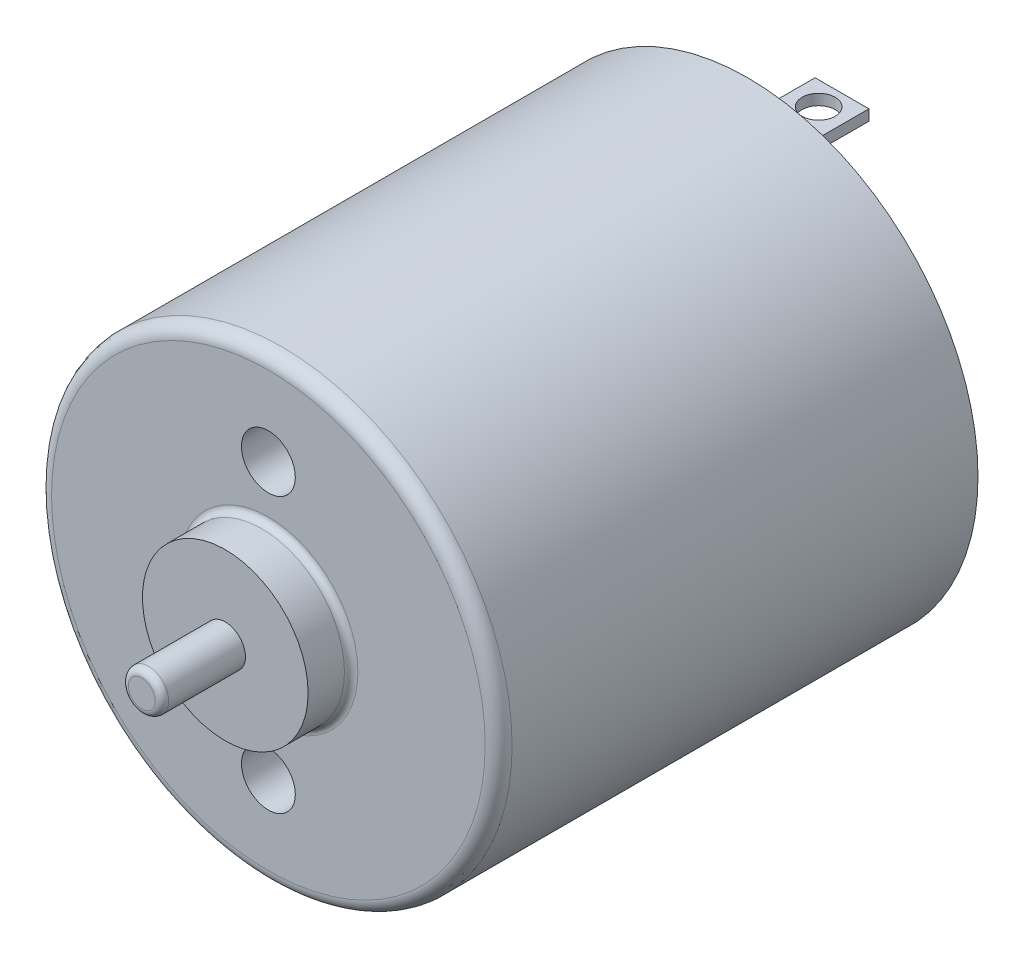
ISO-10303-21;
HEADER;
FILE_DESCRIPTION(('STEP AP214'),'2;1');
FILE_NAME('part.step','',(''),(''),'','','');
FILE_SCHEMA(('AUTOMOTIVE_DESIGN { 1 0 10303 214 1 1 1 1 }'));
ENDSEC;
DATA;
#1=APPLICATION_CONTEXT('core data for automotive mechanical design processes');
#2=APPLICATION_PROTOCOL_DEFINITION('international standard','automotive_design',2000,#1);
#3=PRODUCT_CONTEXT('',#1,'mechanical');
#4=PRODUCT('Part','Part','',(#3));
#5=PRODUCT_RELATED_PRODUCT_CATEGORY('part','',(#4));
#6=PRODUCT_DEFINITION_FORMATION('','',#4);
#7=PRODUCT_DEFINITION_CONTEXT('part definition',#1,'design');
#8=PRODUCT_DEFINITION('design','',#6,#7);
#9=PRODUCT_DEFINITION_SHAPE('','',#8);
#10=(LENGTH_UNIT() NAMED_UNIT(*) SI_UNIT(.MILLI.,.METRE.));
#11=(NAMED_UNIT(*) PLANE_ANGLE_UNIT() SI_UNIT($,.RADIAN.));
#12=(NAMED_UNIT(*) SI_UNIT($,.STERADIAN.) SOLID_ANGLE_UNIT());
#13=UNCERTAINTY_MEASURE_WITH_UNIT(LENGTH_MEASURE(1.E-05),#10,'distance_accuracy_value','');
#14=(GEOMETRIC_REPRESENTATION_CONTEXT(3) GLOBAL_UNCERTAINTY_ASSIGNED_CONTEXT((#13)) GLOBAL_UNIT_ASSIGNED_CONTEXT((#10,
#11,#12)) REPRESENTATION_CONTEXT('',''));
#15=CARTESIAN_POINT('',(0.,0.,0.));
#16=DIRECTION('',(0.,0.,1.));
#17=DIRECTION('',(1.,0.,0.));
#18=AXIS2_PLACEMENT_3D('',#15,#16,#17);
#19=CARTESIAN_POINT('',(0.,0.,0.));
#20=DIRECTION('',(0.,0.,1.));
#21=DIRECTION('',(1.,0.,0.));
#22=AXIS2_PLACEMENT_3D('',#19,#20,#21);
#23=PLANE('',#22);
#24=CARTESIAN_POINT('',(0.,0.,0.));
#25=DIRECTION('',(0.,0.,-1.));
#26=DIRECTION('',(-1.,0.,0.));
#27=AXIS2_PLACEMENT_3D('',#24,#25,#26);
#28=CIRCLE('',#27,8.3);
#29=CARTESIAN_POINT('',(-8.3,0.,0.));
#30=VERTEX_POINT('',#29);
#31=EDGE_CURVE('E56',#30,#30,#28,.T.);
#32=ORIENTED_EDGE('',*,*,#31,.F.);
#33=EDGE_LOOP('',(#32));
#34=FACE_BOUND('',#33,.T.);
#35=CARTESIAN_POINT('',(0.,0.,0.));
#36=DIRECTION('',(0.,0.,1.));
#37=DIRECTION('',(1.,0.,0.));
#38=AXIS2_PLACEMENT_3D('',#35,#36,#37);
#39=CIRCLE('',#38,8.55);
#40=CARTESIAN_POINT('',(8.55,0.,0.));
#41=VERTEX_POINT('',#40);
#42=EDGE_CURVE('E80',#41,#41,#39,.T.);
#43=ORIENTED_EDGE('',*,*,#42,.F.);
#44=EDGE_LOOP('',(#43));
#45=FACE_BOUND('',#44,.T.);
#46=ADVANCED_FACE('F41',(#34,#45),#23,.F.);
#47=CARTESIAN_POINT('',(0.,0.,17.8));
#48=DIRECTION('',(0.,0.,-1.));
#49=DIRECTION('',(-1.,0.,0.));
#50=AXIS2_PLACEMENT_3D('',#47,#48,#49);
#51=CYLINDRICAL_SURFACE('',#50,8.55);
#52=CARTESIAN_POINT('',(0.,0.,17.3));
#53=DIRECTION('',(0.,0.,1.));
#54=DIRECTION('',(1.,0.,0.));
#55=AXIS2_PLACEMENT_3D('',#52,#53,#54);
#56=CIRCLE('',#55,8.55);
#57=CARTESIAN_POINT('',(8.55,0.,17.3));
#58=VERTEX_POINT('',#57);
#59=EDGE_CURVE('E84',#58,#58,#56,.F.);
#60=ORIENTED_EDGE('',*,*,#59,.T.);
#61=EDGE_LOOP('',(#60));
#62=FACE_BOUND('',#61,.T.);
#63=ORIENTED_EDGE('',*,*,#42,.T.);
#64=EDGE_LOOP('',(#63));
#65=FACE_BOUND('',#64,.T.);
#66=ADVANCED_FACE('F125',(#62,#65),#51,.T.);
#67=CARTESIAN_POINT('',(0.,0.,17.8));
#68=DIRECTION('',(0.,0.,1.));
#69=DIRECTION('',(1.,0.,0.));
#70=AXIS2_PLACEMENT_3D('',#67,#68,#69);
#71=PLANE('',#70);
#72=CARTESIAN_POINT('',(0.,0.,17.8));
#73=DIRECTION('',(0.,0.,1.));
#74=DIRECTION('',(1.,0.,0.));
#75=AXIS2_PLACEMENT_3D('',#72,#73,#74);
#76=CIRCLE('',#75,3.325);
#77=CARTESIAN_POINT('',(3.325,0.,17.8));
#78=VERTEX_POINT('',#77);
#79=EDGE_CURVE('E83',#78,#78,#76,.F.);
#80=ORIENTED_EDGE('',*,*,#79,.T.);
#81=EDGE_LOOP('',(#80));
#82=FACE_BOUND('',#81,.T.);
#83=CARTESIAN_POINT('',(0.,0.,17.8));
#84=DIRECTION('',(0.,0.,1.));
#85=DIRECTION('',(1.,0.,0.));
#86=AXIS2_PLACEMENT_3D('',#83,#84,#85);
#87=CIRCLE('',#86,8.05);
#88=CARTESIAN_POINT('',(8.05,0.,17.8));
#89=VERTEX_POINT('',#88);
#90=EDGE_CURVE('E85',#89,#89,#87,.T.);
#91=ORIENTED_EDGE('',*,*,#90,.T.);
#92=EDGE_LOOP('',(#91));
#93=FACE_BOUND('',#92,.T.);
#94=CARTESIAN_POINT('',(0.,-5.1,17.8));
#95=DIRECTION('',(0.,0.,1.));
#96=DIRECTION('',(1.,0.,0.));
#97=AXIS2_PLACEMENT_3D('',#94,#95,#96);
#98=CIRCLE('',#97,1.);
#99=CARTESIAN_POINT('',(1.,-5.1,17.8));
#100=VERTEX_POINT('',#99);
#101=EDGE_CURVE('E64',#100,#100,#98,.T.);
#102=ORIENTED_EDGE('',*,*,#101,.F.);
#103=EDGE_LOOP('',(#102));
#104=FACE_BOUND('',#103,.T.);
#105=CARTESIAN_POINT('',(0.,5.1,17.8));
#106=DIRECTION('',(0.,0.,1.));
#107=DIRECTION('',(1.,0.,0.));
#108=AXIS2_PLACEMENT_3D('',#105,#106,#107);
#109=CIRCLE('',#108,1.);
#110=CARTESIAN_POINT('',(0.999999999999998,5.1,17.8));
#111=VERTEX_POINT('',#110);
#112=EDGE_CURVE('E70',#111,#111,#109,.T.);
#113=ORIENTED_EDGE('',*,*,#112,.F.);
#114=EDGE_LOOP('',(#113));
#115=FACE_BOUND('',#114,.T.);
#116=ADVANCED_FACE('F95',(#82,#93,#104,#115),#71,.T.);
#117=CARTESIAN_POINT('',(0.,0.,19.4));
#118=DIRECTION('',(0.,0.,-1.));
#119=DIRECTION('',(-1.,0.,0.));
#120=AXIS2_PLACEMENT_3D('',#117,#118,#119);
#121=CYLINDRICAL_SURFACE('',#120,3.075);
#122=CARTESIAN_POINT('',(0.,0.,18.05));
#123=DIRECTION('',(0.,0.,1.));
#124=DIRECTION('',(1.,0.,0.));
#125=AXIS2_PLACEMENT_3D('',#122,#123,#124);
#126=CIRCLE('',#125,3.075);
#127=CARTESIAN_POINT('',(3.075,0.,18.05));
#128=VERTEX_POINT('',#127);
#129=EDGE_CURVE('E79',#128,#128,#126,.T.);
#130=ORIENTED_EDGE('',*,*,#129,.T.);
#131=EDGE_LOOP('',(#130));
#132=FACE_BOUND('',#131,.T.);
#133=CARTESIAN_POINT('',(0.,0.,19.4));
#134=DIRECTION('',(0.,0.,1.));
#135=DIRECTION('',(1.,0.,0.));
#136=AXIS2_PLACEMENT_3D('',#133,#134,#135);
#137=CIRCLE('',#136,3.075);
#138=CARTESIAN_POINT('',(3.075,0.,19.4));
#139=VERTEX_POINT('',#138);
#140=EDGE_CURVE('E76',#139,#139,#137,.T.);
#141=ORIENTED_EDGE('',*,*,#140,.F.);
#142=EDGE_LOOP('',(#141));
#143=FACE_BOUND('',#142,.T.);
#144=ADVANCED_FACE('F106',(#132,#143),#121,.T.);
#145=CARTESIAN_POINT('',(0.,0.,19.4));
#146=DIRECTION('',(0.,0.,1.));
#147=DIRECTION('',(1.,0.,0.));
#148=AXIS2_PLACEMENT_3D('',#145,#146,#147);
#149=PLANE('',#148);
#150=CARTESIAN_POINT('',(0.,0.,19.4));
#151=DIRECTION('',(0.,0.,1.));
#152=DIRECTION('',(1.,0.,0.));
#153=AXIS2_PLACEMENT_3D('',#150,#151,#152);
#154=CIRCLE('',#153,0.75);
#155=CARTESIAN_POINT('',(0.75,0.,19.4));
#156=VERTEX_POINT('',#155);
#157=EDGE_CURVE('E73',#156,#156,#154,.T.);
#158=ORIENTED_EDGE('',*,*,#157,.F.);
#159=EDGE_LOOP('',(#158));
#160=FACE_BOUND('',#159,.T.);
#161=ORIENTED_EDGE('',*,*,#140,.T.);
#162=EDGE_LOOP('',(#161));
#163=FACE_BOUND('',#162,.T.);
#164=ADVANCED_FACE('F109',(#160,#163),#149,.T.);
#165=CARTESIAN_POINT('',(0.,0.,29.3213203435596));
#166=DIRECTION('',(0.,0.,-1.));
#167=DIRECTION('',(-1.,0.,0.));
#168=AXIS2_PLACEMENT_3D('',#165,#166,#167);
#169=CYLINDRICAL_SURFACE('',#168,0.75);
#170=CARTESIAN_POINT('',(0.,0.,22.25));
#171=DIRECTION('',(0.,0.,1.));
#172=DIRECTION('',(1.,0.,0.));
#173=AXIS2_PLACEMENT_3D('',#170,#171,#172);
#174=CIRCLE('',#173,0.75);
#175=CARTESIAN_POINT('',(0.75,0.,22.25));
#176=VERTEX_POINT('',#175);
#177=EDGE_CURVE('E11',#176,#176,#174,.F.);
#178=ORIENTED_EDGE('',*,*,#177,.T.);
#179=EDGE_LOOP('',(#178));
#180=FACE_BOUND('',#179,.T.);
#181=ORIENTED_EDGE('',*,*,#157,.T.);
#182=EDGE_LOOP('',(#181));
#183=FACE_BOUND('',#182,.T.);
#184=ADVANCED_FACE('F114',(#180,#183),#169,.T.);
#185=CARTESIAN_POINT('',(0.,0.,22.5));
#186=DIRECTION('',(0.,0.,1.));
#187=DIRECTION('',(1.,0.,0.));
#188=AXIS2_PLACEMENT_3D('',#185,#186,#187);
#189=PLANE('',#188);
#190=CARTESIAN_POINT('',(0.,0.,22.5));
#191=DIRECTION('',(0.,0.,1.));
#192=DIRECTION('',(1.,0.,0.));
#193=AXIS2_PLACEMENT_3D('',#190,#191,#192);
#194=CIRCLE('',#193,0.5);
#195=CARTESIAN_POINT('',(0.5,0.,22.5));
#196=VERTEX_POINT('',#195);
#197=EDGE_CURVE('E48',#196,#196,#194,.T.);
#198=ORIENTED_EDGE('',*,*,#197,.T.);
#199=EDGE_LOOP('',(#198));
#200=FACE_BOUND('',#199,.T.);
#201=ADVANCED_FACE('F120',(#200),#189,.T.);
#202=CARTESIAN_POINT('',(0.,5.1,15.8));
#203=DIRECTION('',(0.,0.,1.));
#204=DIRECTION('',(1.,0.,0.));
#205=AXIS2_PLACEMENT_3D('',#202,#203,#204);
#206=CYLINDRICAL_SURFACE('',#205,1.);
#207=CARTESIAN_POINT('',(0.,5.1,15.8));
#208=DIRECTION('',(0.,0.,1.));
#209=DIRECTION('',(1.,0.,0.));
#210=AXIS2_PLACEMENT_3D('',#207,#208,#209);
#211=CIRCLE('',#210,1.);
#212=CARTESIAN_POINT('',(0.999999999999998,5.1,15.8));
#213=VERTEX_POINT('',#212);
#214=EDGE_CURVE('E67',#213,#213,#211,.T.);
#215=ORIENTED_EDGE('',*,*,#214,.F.);
#216=EDGE_LOOP('',(#215));
#217=FACE_BOUND('',#216,.T.);
#218=ORIENTED_EDGE('',*,*,#112,.T.);
#219=EDGE_LOOP('',(#218));
#220=FACE_BOUND('',#219,.T.);
#221=ADVANCED_FACE('F156',(#217,#220),#206,.F.);
#222=CARTESIAN_POINT('',(0.,5.1,15.8));
#223=DIRECTION('',(0.,0.,1.));
#224=DIRECTION('',(1.,0.,0.));
#225=AXIS2_PLACEMENT_3D('',#222,#223,#224);
#226=PLANE('',#225);
#227=ORIENTED_EDGE('',*,*,#214,.T.);
#228=EDGE_LOOP('',(#227));
#229=FACE_BOUND('',#228,.T.);
#230=ADVANCED_FACE('F161',(#229),#226,.T.);
#231=CARTESIAN_POINT('',(0.,-5.1,15.8));
#232=DIRECTION('',(0.,0.,1.));
#233=DIRECTION('',(1.,0.,0.));
#234=AXIS2_PLACEMENT_3D('',#231,#232,#233);
#235=CYLINDRICAL_SURFACE('',#234,1.);
#236=CARTESIAN_POINT('',(0.,-5.1,15.8));
#237=DIRECTION('',(0.,0.,1.));
#238=DIRECTION('',(1.,0.,0.));
#239=AXIS2_PLACEMENT_3D('',#236,#237,#238);
#240=CIRCLE('',#239,1.);
#241=CARTESIAN_POINT('',(1.,-5.1,15.8));
#242=VERTEX_POINT('',#241);
#243=EDGE_CURVE('E61',#242,#242,#240,.T.);
#244=ORIENTED_EDGE('',*,*,#243,.F.);
#245=EDGE_LOOP('',(#244));
#246=FACE_BOUND('',#245,.T.);
#247=ORIENTED_EDGE('',*,*,#101,.T.);
#248=EDGE_LOOP('',(#247));
#249=FACE_BOUND('',#248,.T.);
#250=ADVANCED_FACE('F173',(#246,#249),#235,.F.);
#251=CARTESIAN_POINT('',(0.,-5.1,15.8));
#252=DIRECTION('',(0.,0.,1.));
#253=DIRECTION('',(1.,0.,0.));
#254=AXIS2_PLACEMENT_3D('',#251,#252,#253);
#255=PLANE('',#254);
#256=ORIENTED_EDGE('',*,*,#243,.T.);
#257=EDGE_LOOP('',(#256));
#258=FACE_BOUND('',#257,.T.);
#259=ADVANCED_FACE('F183',(#258),#255,.T.);
#260=CARTESIAN_POINT('',(0.,0.,17.3));
#261=DIRECTION('',(0.,0.,1.));
#262=DIRECTION('',(1.,0.,0.));
#263=AXIS2_PLACEMENT_3D('',#260,#261,#262);
#264=TOROIDAL_SURFACE('',#263,8.05,0.5);
#265=ORIENTED_EDGE('',*,*,#59,.F.);
#266=EDGE_LOOP('',(#265));
#267=FACE_BOUND('',#266,.T.);
#268=ORIENTED_EDGE('',*,*,#90,.F.);
#269=EDGE_LOOP('',(#268));
#270=FACE_BOUND('',#269,.T.);
#271=ADVANCED_FACE('F102',(#267,#270),#264,.T.);
#272=CARTESIAN_POINT('',(0.,0.,18.05));
#273=DIRECTION('',(0.,0.,1.));
#274=DIRECTION('',(1.,0.,0.));
#275=AXIS2_PLACEMENT_3D('',#272,#273,#274);
#276=TOROIDAL_SURFACE('',#275,3.325,0.25);
#277=ORIENTED_EDGE('',*,*,#79,.F.);
#278=EDGE_LOOP('',(#277));
#279=FACE_BOUND('',#278,.T.);
#280=ORIENTED_EDGE('',*,*,#129,.F.);
#281=EDGE_LOOP('',(#280));
#282=FACE_BOUND('',#281,.T.);
#283=ADVANCED_FACE('F98',(#279,#282),#276,.F.);
#284=CARTESIAN_POINT('',(0.,0.,0.5));
#285=DIRECTION('',(0.,0.,-1.));
#286=DIRECTION('',(-1.,0.,0.));
#287=AXIS2_PLACEMENT_3D('',#284,#285,#286);
#288=CYLINDRICAL_SURFACE('',#287,8.3);
#289=CARTESIAN_POINT('',(0.,0.,0.5));
#290=DIRECTION('',(0.,0.,-1.));
#291=DIRECTION('',(-1.,0.,0.));
#292=AXIS2_PLACEMENT_3D('',#289,#290,#291);
#293=CIRCLE('',#292,8.3);
#294=CARTESIAN_POINT('',(-8.3,0.,0.5));
#295=VERTEX_POINT('',#294);
#296=EDGE_CURVE('E52',#295,#295,#293,.T.);
#297=ORIENTED_EDGE('',*,*,#296,.F.);
#298=EDGE_LOOP('',(#297));
#299=FACE_BOUND('',#298,.T.);
#300=ORIENTED_EDGE('',*,*,#31,.T.);
#301=EDGE_LOOP('',(#300));
#302=FACE_BOUND('',#301,.T.);
#303=ADVANCED_FACE('F101',(#299,#302),#288,.F.);
#304=CARTESIAN_POINT('',(0.,0.,0.5));
#305=DIRECTION('',(0.,0.,-1.));
#306=DIRECTION('',(-1.,0.,0.));
#307=AXIS2_PLACEMENT_3D('',#304,#305,#306);
#308=PLANE('',#307);
#309=ORIENTED_EDGE('',*,*,#296,.T.);
#310=EDGE_LOOP('',(#309));
#311=FACE_BOUND('',#310,.T.);
#312=ADVANCED_FACE('F216',(#311),#308,.T.);
#313=CARTESIAN_POINT('',(0.,0.,22.25));
#314=DIRECTION('',(0.,0.,1.));
#315=DIRECTION('',(1.,0.,0.));
#316=AXIS2_PLACEMENT_3D('',#313,#314,#315);
#317=TOROIDAL_SURFACE('',#316,0.5,0.25);
#318=ORIENTED_EDGE('',*,*,#177,.F.);
#319=EDGE_LOOP('',(#318));
#320=FACE_BOUND('',#319,.T.);
#321=ORIENTED_EDGE('',*,*,#197,.F.);
#322=EDGE_LOOP('',(#321));
#323=FACE_BOUND('',#322,.T.);
#324=ADVANCED_FACE('F43',(#320,#323),#317,.T.);
#325=CLOSED_SHELL('',(#46,#66,#116,#144,#164,#184,#201,#221,#230,#250,#259,#271,#283,#303,#312,#324));
#326=MANIFOLD_SOLID_BREP('B2',#325);
#327=CARTESIAN_POINT('',(0.,0.,-3.5));
#328=DIRECTION('',(0.,0.,1.));
#329=DIRECTION('',(1.,0.,0.));
#330=AXIS2_PLACEMENT_3D('',#327,#328,#329);
#331=PLANE('',#330);
#332=DIRECTION('',(0.,1.,0.));
#333=VECTOR('',#332,1.);
#334=CARTESIAN_POINT('',(-0.999999999999997,-6.3,-3.5));
#335=LINE('',#334,#333);
#336=CARTESIAN_POINT('',(-0.999999999999997,-6.3,-3.5));
#337=VERTEX_POINT('',#336);
#338=CARTESIAN_POINT('',(-0.999999999999997,-5.9,-3.5));
#339=VERTEX_POINT('',#338);
#340=EDGE_CURVE('E353',#337,#339,#335,.T.);
#341=ORIENTED_EDGE('',*,*,#340,.T.);
#342=DIRECTION('',(1.,0.,0.));
#343=VECTOR('',#342,1.);
#344=CARTESIAN_POINT('',(1.,-5.9,-3.5));
#345=LINE('',#344,#343);
#346=CARTESIAN_POINT('',(1.,-5.9,-3.5));
#347=VERTEX_POINT('',#346);
#348=EDGE_CURVE('E352',#339,#347,#345,.T.);
#349=ORIENTED_EDGE('',*,*,#348,.T.);
#350=DIRECTION('',(0.,-1.,0.));
#351=VECTOR('',#350,1.);
#352=CARTESIAN_POINT('',(1.,-6.3,-3.5));
#353=LINE('',#352,#351);
#354=CARTESIAN_POINT('',(1.,-6.3,-3.5));
#355=VERTEX_POINT('',#354);
#356=EDGE_CURVE('E350',#347,#355,#353,.T.);
#357=ORIENTED_EDGE('',*,*,#356,.T.);
#358=DIRECTION('',(-1.,0.,0.));
#359=VECTOR('',#358,1.);
#360=CARTESIAN_POINT('',(1.,-6.3,-3.5));
#361=LINE('',#360,#359);
#362=EDGE_CURVE('E329',#355,#337,#361,.T.);
#363=ORIENTED_EDGE('',*,*,#362,.T.);
#364=EDGE_LOOP('',(#341,#349,#357,#363));
#365=FACE_BOUND('',#364,.T.);
#366=ADVANCED_FACE('F286',(#365),#331,.F.);
#367=CARTESIAN_POINT('',(1.,-6.3,-3.5));
#368=DIRECTION('',(0.,1.,0.));
#369=DIRECTION('',(0.,0.,1.));
#370=AXIS2_PLACEMENT_3D('',#367,#368,#369);
#371=PLANE('',#370);
#372=CARTESIAN_POINT('',(0.,-6.3,-2.63292970690516));
#373=DIRECTION('',(0.,1.,0.));
#374=DIRECTION('',(0.,0.,1.));
#375=AXIS2_PLACEMENT_3D('',#372,#373,#374);
#376=CIRCLE('',#375,0.613220662913288);
#377=CARTESIAN_POINT('',(0.,-6.3,-2.01970904399187));
#378=VERTEX_POINT('',#377);
#379=EDGE_CURVE('E355',#378,#378,#376,.T.);
#380=ORIENTED_EDGE('',*,*,#379,.T.);
#381=EDGE_LOOP('',(#380));
#382=FACE_BOUND('',#381,.T.);
#383=DIRECTION('',(-1.,0.,0.));
#384=VECTOR('',#383,1.);
#385=CARTESIAN_POINT('',(1.,-6.3,0.));
#386=LINE('',#385,#384);
#387=CARTESIAN_POINT('',(1.,-6.3,0.));
#388=VERTEX_POINT('',#387);
#389=CARTESIAN_POINT('',(-0.999999999999997,-6.3,0.));
#390=VERTEX_POINT('',#389);
#391=EDGE_CURVE('E324',#388,#390,#386,.T.);
#392=ORIENTED_EDGE('',*,*,#391,.T.);
#393=DIRECTION('',(0.,0.,1.));
#394=VECTOR('',#393,1.);
#395=CARTESIAN_POINT('',(-0.999999999999997,-6.3,-3.5));
#396=LINE('',#395,#394);
#397=EDGE_CURVE('E39',#337,#390,#396,.T.);
#398=ORIENTED_EDGE('',*,*,#397,.F.);
#399=ORIENTED_EDGE('',*,*,#362,.F.);
#400=DIRECTION('',(0.,0.,1.));
#401=VECTOR('',#400,1.);
#402=CARTESIAN_POINT('',(1.,-6.3,-3.5));
#403=LINE('',#402,#401);
#404=EDGE_CURVE('E328',#355,#388,#403,.T.);
#405=ORIENTED_EDGE('',*,*,#404,.T.);
#406=EDGE_LOOP('',(#392,#398,#399,#405));
#407=FACE_BOUND('',#406,.T.);
#408=ADVANCED_FACE('F340',(#382,#407),#371,.F.);
#409=CARTESIAN_POINT('',(1.,-6.3,-3.5));
#410=DIRECTION('',(-1.,0.,0.));
#411=DIRECTION('',(0.,0.,1.));
#412=AXIS2_PLACEMENT_3D('',#409,#410,#411);
#413=PLANE('',#412);
#414=DIRECTION('',(0.,-1.,0.));
#415=VECTOR('',#414,1.);
#416=CARTESIAN_POINT('',(1.,-6.3,0.));
#417=LINE('',#416,#415);
#418=CARTESIAN_POINT('',(1.,-5.9,0.));
#419=VERTEX_POINT('',#418);
#420=EDGE_CURVE('E322',#419,#388,#417,.T.);
#421=ORIENTED_EDGE('',*,*,#420,.T.);
#422=ORIENTED_EDGE('',*,*,#404,.F.);
#423=ORIENTED_EDGE('',*,*,#356,.F.);
#424=DIRECTION('',(0.,0.,1.));
#425=VECTOR('',#424,1.);
#426=CARTESIAN_POINT('',(1.,-5.9,-3.5));
#427=LINE('',#426,#425);
#428=EDGE_CURVE('E338',#347,#419,#427,.T.);
#429=ORIENTED_EDGE('',*,*,#428,.T.);
#430=EDGE_LOOP('',(#421,#422,#423,#429));
#431=FACE_BOUND('',#430,.T.);
#432=ADVANCED_FACE('F334',(#431),#413,.F.);
#433=CARTESIAN_POINT('',(1.,-5.9,-3.5));
#434=DIRECTION('',(0.,-1.,0.));
#435=DIRECTION('',(0.,0.,-1.));
#436=AXIS2_PLACEMENT_3D('',#433,#434,#435);
#437=PLANE('',#436);
#438=CARTESIAN_POINT('',(0.,-5.9,-2.63292970690516));
#439=DIRECTION('',(0.,-1.,0.));
#440=DIRECTION('',(0.,0.,-1.));
#441=AXIS2_PLACEMENT_3D('',#438,#439,#440);
#442=CIRCLE('',#441,0.613220662913288);
#443=CARTESIAN_POINT('',(0.,-5.9,-3.24615036981845));
#444=VERTEX_POINT('',#443);
#445=EDGE_CURVE('E290',#444,#444,#442,.T.);
#446=ORIENTED_EDGE('',*,*,#445,.T.);
#447=EDGE_LOOP('',(#446));
#448=FACE_BOUND('',#447,.T.);
#449=DIRECTION('',(1.,0.,0.));
#450=VECTOR('',#449,1.);
#451=CARTESIAN_POINT('',(1.,-5.9,0.));
#452=LINE('',#451,#450);
#453=CARTESIAN_POINT('',(-0.999999999999996,-5.9,0.));
#454=VERTEX_POINT('',#453);
#455=EDGE_CURVE('E345',#454,#419,#452,.T.);
#456=ORIENTED_EDGE('',*,*,#455,.T.);
#457=ORIENTED_EDGE('',*,*,#428,.F.);
#458=ORIENTED_EDGE('',*,*,#348,.F.);
#459=DIRECTION('',(0.,0.,1.));
#460=VECTOR('',#459,1.);
#461=CARTESIAN_POINT('',(-0.999999999999997,-5.9,-3.5));
#462=LINE('',#461,#460);
#463=EDGE_CURVE('E347',#339,#454,#462,.T.);
#464=ORIENTED_EDGE('',*,*,#463,.T.);
#465=EDGE_LOOP('',(#456,#457,#458,#464));
#466=FACE_BOUND('',#465,.T.);
#467=ADVANCED_FACE('F366',(#448,#466),#437,.F.);
#468=CARTESIAN_POINT('',(-0.999999999999997,-6.3,-3.5));
#469=DIRECTION('',(1.,0.,0.));
#470=DIRECTION('',(0.,0.,-1.));
#471=AXIS2_PLACEMENT_3D('',#468,#469,#470);
#472=PLANE('',#471);
#473=DIRECTION('',(0.,1.,0.));
#474=VECTOR('',#473,1.);
#475=CARTESIAN_POINT('',(-0.999999999999997,-6.3,0.));
#476=LINE('',#475,#474);
#477=EDGE_CURVE('E296',#390,#454,#476,.T.);
#478=ORIENTED_EDGE('',*,*,#477,.T.);
#479=ORIENTED_EDGE('',*,*,#463,.F.);
#480=ORIENTED_EDGE('',*,*,#340,.F.);
#481=ORIENTED_EDGE('',*,*,#397,.T.);
#482=EDGE_LOOP('',(#478,#479,#480,#481));
#483=FACE_BOUND('',#482,.T.);
#484=ADVANCED_FACE('F368',(#483),#472,.F.);
#485=CARTESIAN_POINT('',(0.,0.,0.));
#486=DIRECTION('',(0.,0.,-1.));
#487=DIRECTION('',(-1.,0.,0.));
#488=AXIS2_PLACEMENT_3D('',#485,#486,#487);
#489=PLANE('',#488);
#490=ORIENTED_EDGE('',*,*,#391,.F.);
#491=ORIENTED_EDGE('',*,*,#420,.F.);
#492=ORIENTED_EDGE('',*,*,#455,.F.);
#493=ORIENTED_EDGE('',*,*,#477,.F.);
#494=EDGE_LOOP('',(#490,#491,#492,#493));
#495=FACE_BOUND('',#494,.T.);
#496=ADVANCED_FACE('F288',(#495),#489,.F.);
#497=CARTESIAN_POINT('',(0.,-9.2,-2.63292970690516));
#498=DIRECTION('',(0.,1.,0.));
#499=DIRECTION('',(0.,0.,1.));
#500=AXIS2_PLACEMENT_3D('',#497,#498,#499);
#501=CYLINDRICAL_SURFACE('',#500,0.613220662913288);
#502=ORIENTED_EDGE('',*,*,#445,.F.);
#503=EDGE_LOOP('',(#502));
#504=FACE_BOUND('',#503,.T.);
#505=ORIENTED_EDGE('',*,*,#379,.F.);
#506=EDGE_LOOP('',(#505));
#507=FACE_BOUND('',#506,.T.);
#508=ADVANCED_FACE('F375',(#504,#507),#501,.F.);
#509=CLOSED_SHELL('',(#366,#408,#432,#467,#484,#496,#508));
#510=MANIFOLD_SOLID_BREP('B6',#509);
#511=CARTESIAN_POINT('',(0.,0.,-3.5));
#512=DIRECTION('',(0.,0.,1.));
#513=DIRECTION('',(1.,0.,0.));
#514=AXIS2_PLACEMENT_3D('',#511,#512,#513);
#515=PLANE('',#514);
#516=DIRECTION('',(0.,1.,0.));
#517=VECTOR('',#516,1.);
#518=CARTESIAN_POINT('',(-0.999999999999997,5.9,-3.5));
#519=LINE('',#518,#517);
#520=CARTESIAN_POINT('',(-0.999999999999997,5.9,-3.5));
#521=VERTEX_POINT('',#520);
#522=CARTESIAN_POINT('',(-0.999999999999997,6.3,-3.5));
#523=VERTEX_POINT('',#522);
#524=EDGE_CURVE('E444',#521,#523,#519,.T.);
#525=ORIENTED_EDGE('',*,*,#524,.T.);
#526=DIRECTION('',(1.,0.,0.));
#527=VECTOR('',#526,1.);
#528=CARTESIAN_POINT('',(1.,6.3,-3.5));
#529=LINE('',#528,#527);
#530=CARTESIAN_POINT('',(1.,6.3,-3.5));
#531=VERTEX_POINT('',#530);
#532=EDGE_CURVE('E505',#523,#531,#529,.T.);
#533=ORIENTED_EDGE('',*,*,#532,.T.);
#534=DIRECTION('',(0.,-1.,0.));
#535=VECTOR('',#534,1.);
#536=CARTESIAN_POINT('',(1.,5.9,-3.5));
#537=LINE('',#536,#535);
#538=CARTESIAN_POINT('',(1.,5.9,-3.5));
#539=VERTEX_POINT('',#538);
#540=EDGE_CURVE('E504',#531,#539,#537,.T.);
#541=ORIENTED_EDGE('',*,*,#540,.T.);
#542=DIRECTION('',(-1.,0.,0.));
#543=VECTOR('',#542,1.);
#544=CARTESIAN_POINT('',(1.,5.9,-3.5));
#545=LINE('',#544,#543);
#546=EDGE_CURVE('E483',#539,#521,#545,.T.);
#547=ORIENTED_EDGE('',*,*,#546,.T.);
#548=EDGE_LOOP('',(#525,#533,#541,#547));
#549=FACE_BOUND('',#548,.T.);
#550=ADVANCED_FACE('F440',(#549),#515,.F.);
#551=CARTESIAN_POINT('',(1.,5.9,-3.5));
#552=DIRECTION('',(0.,1.,0.));
#553=DIRECTION('',(0.,0.,1.));
#554=AXIS2_PLACEMENT_3D('',#551,#552,#553);
#555=PLANE('',#554);
#556=CARTESIAN_POINT('',(0.,5.9,-2.63292970690516));
#557=DIRECTION('',(0.,1.,0.));
#558=DIRECTION('',(0.,0.,1.));
#559=AXIS2_PLACEMENT_3D('',#556,#557,#558);
#560=CIRCLE('',#559,0.613220662913288);
#561=CARTESIAN_POINT('',(0.,5.9,-2.01970904399187));
#562=VERTEX_POINT('',#561);
#563=EDGE_CURVE('E508',#562,#562,#560,.T.);
#564=ORIENTED_EDGE('',*,*,#563,.T.);
#565=EDGE_LOOP('',(#564));
#566=FACE_BOUND('',#565,.T.);
#567=DIRECTION('',(-1.,0.,0.));
#568=VECTOR('',#567,1.);
#569=CARTESIAN_POINT('',(1.,5.9,0.));
#570=LINE('',#569,#568);
#571=CARTESIAN_POINT('',(1.,5.9,0.));
#572=VERTEX_POINT('',#571);
#573=CARTESIAN_POINT('',(-0.999999999999997,5.9,0.));
#574=VERTEX_POINT('',#573);
#575=EDGE_CURVE('E478',#572,#574,#570,.T.);
#576=ORIENTED_EDGE('',*,*,#575,.T.);
#577=DIRECTION('',(0.,0.,1.));
#578=VECTOR('',#577,1.);
#579=CARTESIAN_POINT('',(-0.999999999999997,5.9,-3.5));
#580=LINE('',#579,#578);
#581=EDGE_CURVE('E284',#521,#574,#580,.T.);
#582=ORIENTED_EDGE('',*,*,#581,.F.);
#583=ORIENTED_EDGE('',*,*,#546,.F.);
#584=DIRECTION('',(0.,0.,1.));
#585=VECTOR('',#584,1.);
#586=CARTESIAN_POINT('',(1.,5.9,-3.5));
#587=LINE('',#586,#585);
#588=EDGE_CURVE('E482',#539,#572,#587,.T.);
#589=ORIENTED_EDGE('',*,*,#588,.T.);
#590=EDGE_LOOP('',(#576,#582,#583,#589));
#591=FACE_BOUND('',#590,.T.);
#592=ADVANCED_FACE('F494',(#566,#591),#555,.F.);
#593=CARTESIAN_POINT('',(1.,5.9,-3.5));
#594=DIRECTION('',(-1.,0.,0.));
#595=DIRECTION('',(0.,0.,1.));
#596=AXIS2_PLACEMENT_3D('',#593,#594,#595);
#597=PLANE('',#596);
#598=DIRECTION('',(0.,-1.,0.));
#599=VECTOR('',#598,1.);
#600=CARTESIAN_POINT('',(1.,5.9,0.));
#601=LINE('',#600,#599);
#602=CARTESIAN_POINT('',(1.,6.3,0.));
#603=VERTEX_POINT('',#602);
#604=EDGE_CURVE('E476',#603,#572,#601,.T.);
#605=ORIENTED_EDGE('',*,*,#604,.T.);
#606=ORIENTED_EDGE('',*,*,#588,.F.);
#607=ORIENTED_EDGE('',*,*,#540,.F.);
#608=DIRECTION('',(0.,0.,1.));
#609=VECTOR('',#608,1.);
#610=CARTESIAN_POINT('',(1.,6.3,-3.5));
#611=LINE('',#610,#609);
#612=EDGE_CURVE('E492',#531,#603,#611,.T.);
#613=ORIENTED_EDGE('',*,*,#612,.T.);
#614=EDGE_LOOP('',(#605,#606,#607,#613));
#615=FACE_BOUND('',#614,.T.);
#616=ADVANCED_FACE('F488',(#615),#597,.F.);
#617=CARTESIAN_POINT('',(1.,6.3,-3.5));
#618=DIRECTION('',(0.,-1.,0.));
#619=DIRECTION('',(0.,0.,-1.));
#620=AXIS2_PLACEMENT_3D('',#617,#618,#619);
#621=PLANE('',#620);
#622=CARTESIAN_POINT('',(0.,6.3,-2.63292970690516));
#623=DIRECTION('',(0.,1.,0.));
#624=DIRECTION('',(0.,0.,1.));
#625=AXIS2_PLACEMENT_3D('',#622,#623,#624);
#626=CIRCLE('',#625,0.613220662913288);
#627=CARTESIAN_POINT('',(0.,6.3,-2.01970904399187));
#628=VERTEX_POINT('',#627);
#629=EDGE_CURVE('E512',#628,#628,#626,.T.);
#630=ORIENTED_EDGE('',*,*,#629,.F.);
#631=EDGE_LOOP('',(#630));
#632=FACE_BOUND('',#631,.T.);
#633=DIRECTION('',(1.,0.,0.));
#634=VECTOR('',#633,1.);
#635=CARTESIAN_POINT('',(1.,6.3,0.));
#636=LINE('',#635,#634);
#637=CARTESIAN_POINT('',(-0.999999999999996,6.3,0.));
#638=VERTEX_POINT('',#637);
#639=EDGE_CURVE('E499',#638,#603,#636,.T.);
#640=ORIENTED_EDGE('',*,*,#639,.T.);
#641=ORIENTED_EDGE('',*,*,#612,.F.);
#642=ORIENTED_EDGE('',*,*,#532,.F.);
#643=DIRECTION('',(0.,0.,1.));
#644=VECTOR('',#643,1.);
#645=CARTESIAN_POINT('',(-0.999999999999997,6.3,-3.5));
#646=LINE('',#645,#644);
#647=EDGE_CURVE('E501',#523,#638,#646,.T.);
#648=ORIENTED_EDGE('',*,*,#647,.T.);
#649=EDGE_LOOP('',(#640,#641,#642,#648));
#650=FACE_BOUND('',#649,.T.);
#651=ADVANCED_FACE('F520',(#632,#650),#621,.F.);
#652=CARTESIAN_POINT('',(-0.999999999999997,5.9,-3.5));
#653=DIRECTION('',(1.,0.,0.));
#654=DIRECTION('',(0.,0.,-1.));
#655=AXIS2_PLACEMENT_3D('',#652,#653,#654);
#656=PLANE('',#655);
#657=DIRECTION('',(0.,1.,0.));
#658=VECTOR('',#657,1.);
#659=CARTESIAN_POINT('',(-0.999999999999997,5.9,0.));
#660=LINE('',#659,#658);
#661=EDGE_CURVE('E450',#574,#638,#660,.T.);
#662=ORIENTED_EDGE('',*,*,#661,.T.);
#663=ORIENTED_EDGE('',*,*,#647,.F.);
#664=ORIENTED_EDGE('',*,*,#524,.F.);
#665=ORIENTED_EDGE('',*,*,#581,.T.);
#666=EDGE_LOOP('',(#662,#663,#664,#665));
#667=FACE_BOUND('',#666,.T.);
#668=ADVANCED_FACE('F522',(#667),#656,.F.);
#669=CARTESIAN_POINT('',(0.,0.,0.));
#670=DIRECTION('',(0.,0.,-1.));
#671=DIRECTION('',(-1.,0.,0.));
#672=AXIS2_PLACEMENT_3D('',#669,#670,#671);
#673=PLANE('',#672);
#674=ORIENTED_EDGE('',*,*,#575,.F.);
#675=ORIENTED_EDGE('',*,*,#604,.F.);
#676=ORIENTED_EDGE('',*,*,#639,.F.);
#677=ORIENTED_EDGE('',*,*,#661,.F.);
#678=EDGE_LOOP('',(#674,#675,#676,#677));
#679=FACE_BOUND('',#678,.T.);
#680=ADVANCED_FACE('F442',(#679),#673,.F.);
#681=CARTESIAN_POINT('',(0.,-9.2,-2.63292970690516));
#682=DIRECTION('',(0.,1.,0.));
#683=DIRECTION('',(0.,0.,1.));
#684=AXIS2_PLACEMENT_3D('',#681,#682,#683);
#685=CYLINDRICAL_SURFACE('',#684,0.613220662913288);
#686=ORIENTED_EDGE('',*,*,#629,.T.);
#687=EDGE_LOOP('',(#686));
#688=FACE_BOUND('',#687,.T.);
#689=ORIENTED_EDGE('',*,*,#563,.F.);
#690=EDGE_LOOP('',(#689));
#691=FACE_BOUND('',#690,.T.);
#692=ADVANCED_FACE('F529',(#688,#691),#685,.F.);
#693=CLOSED_SHELL('',(#550,#592,#616,#651,#668,#680,#692));
#694=MANIFOLD_SOLID_BREP('B33',#693);
#695=CARTESIAN_POINT('',(0.,0.,-2.16));
#696=DIRECTION('',(0.,0.,-1.));
#697=DIRECTION('',(-1.,0.,0.));
#698=AXIS2_PLACEMENT_3D('',#695,#696,#697);
#699=PLANE('',#698);
#700=DIRECTION('',(0.,1.,0.));
#701=VECTOR('',#700,1.);
#702=CARTESIAN_POINT('',(-0.390355061130775,-9.2,-2.16));
#703=LINE('',#702,#701);
#704=CARTESIAN_POINT('',(-0.390355061130775,-1.80834812086876,-2.16));
#705=VERTEX_POINT('',#704);
#706=CARTESIAN_POINT('',(-0.390355061130775,1.80834812086876,-2.16));
#707=VERTEX_POINT('',#706);
#708=EDGE_CURVE('E603',#705,#707,#703,.T.);
#709=ORIENTED_EDGE('',*,*,#708,.F.);
#710=CARTESIAN_POINT('',(0.,0.,-2.16));
#711=DIRECTION('',(0.,0.,-1.));
#712=DIRECTION('',(-1.,0.,0.));
#713=AXIS2_PLACEMENT_3D('',#710,#711,#712);
#714=CIRCLE('',#713,1.85);
#715=EDGE_CURVE('E625',#705,#707,#714,.T.);
#716=ORIENTED_EDGE('',*,*,#715,.T.);
#717=EDGE_LOOP('',(#709,#716));
#718=FACE_BOUND('',#717,.T.);
#719=ADVANCED_FACE('F585',(#718),#699,.T.);
#720=DIRECTION('',(0.,1.,0.));
#721=VECTOR('',#720,1.);
#722=CARTESIAN_POINT('',(0.390355061130775,-9.2,-2.16));
#723=LINE('',#722,#721);
#724=CARTESIAN_POINT('',(0.390355061130782,1.80834812086876,-2.16));
#725=VERTEX_POINT('',#724);
#726=CARTESIAN_POINT('',(0.390355061130775,-1.80834812086876,-2.16));
#727=VERTEX_POINT('',#726);
#728=EDGE_CURVE('E613',#725,#727,#723,.F.);
#729=ORIENTED_EDGE('',*,*,#728,.F.);
#730=EDGE_CURVE('E622',#725,#727,#714,.T.);
#731=ORIENTED_EDGE('',*,*,#730,.T.);
#732=EDGE_LOOP('',(#729,#731));
#733=FACE_BOUND('',#732,.T.);
#734=ADVANCED_FACE('F621',(#733),#699,.T.);
#735=CARTESIAN_POINT('',(0.,0.,-1.66));
#736=DIRECTION('',(0.,0.,-1.));
#737=DIRECTION('',(-1.,0.,0.));
#738=AXIS2_PLACEMENT_3D('',#735,#736,#737);
#739=TOROIDAL_SURFACE('',#738,1.85,0.5);
#740=CARTESIAN_POINT('',(-0.300373360774192,-2.06889567268018,-2.09831301799525));
#741=CARTESIAN_POINT('',(-0.313255438899147,-2.05370066155252,-2.10555049448293));
#742=CARTESIAN_POINT('',(-0.324824437204547,-2.03732995957864,-2.1126643541303));
#743=CARTESIAN_POINT('',(-0.345213181223388,-2.00261051966879,-2.12596192230821));
#744=CARTESIAN_POINT('',(-0.354031890411103,-1.98426103947097,-2.13214527969893));
#745=CARTESIAN_POINT('',(-0.368877015696258,-1.94602191442395,-2.14297651007581));
#746=CARTESIAN_POINT('',(-0.374901390488656,-1.92613115598705,-2.14762325983692));
#747=CARTESIAN_POINT('',(-0.384102024993774,-1.8853226488728,-2.15487114396581));
#748=CARTESIAN_POINT('',(-0.38727689549804,-1.86440440450473,-2.15747128047979));
#749=CARTESIAN_POINT('',(-0.390611756253764,-1.82253251492937,-2.1602069453105));
#750=CARTESIAN_POINT('',(-0.390824175628682,-1.80158606594905,-2.16038533196645));
#751=CARTESIAN_POINT('',(-0.388102339040612,-1.76004318328443,-2.15814530736229));
#752=CARTESIAN_POINT('',(-0.385174605247143,-1.73944611403017,-2.1557322785178));
#753=CARTESIAN_POINT('',(-0.377122603562464,-1.70511564217914,-2.1493644134233));
#754=CARTESIAN_POINT('',(-0.372837200683861,-1.69106832203636,-2.14602616716251));
#755=CARTESIAN_POINT('',(-0.362324899665256,-1.66408377058905,-2.13815355734624));
#756=CARTESIAN_POINT('',(-0.35610024432322,-1.65114527882372,-2.13362057646162));
#757=CARTESIAN_POINT('',(-0.34166530963979,-1.62676836265695,-2.123635072337));
#758=CARTESIAN_POINT('',(-0.333449828301246,-1.61533399128659,-2.11818015156954));
#759=CARTESIAN_POINT('',(-0.31518200052419,-1.59432226150218,-2.10679738798164));
#760=CARTESIAN_POINT('',(-0.305129345151649,-1.58474521596996,-2.10086946571719));
#761=CARTESIAN_POINT('',(-0.283809150965317,-1.56779799302052,-2.08920654698171));
#762=CARTESIAN_POINT('',(-0.272587010501615,-1.56037031473107,-2.08347108932788));
#763=CARTESIAN_POINT('',(-0.249011493778319,-1.54722046976819,-2.07239133023753));
#764=CARTESIAN_POINT('',(-0.236657195605364,-1.54149970945774,-2.06704735407005));
#765=CARTESIAN_POINT('',(-0.203853413230386,-1.52869445755861,-2.05418652387156));
#766=CARTESIAN_POINT('',(-0.182793140223439,-1.52268230371711,-2.047160543784));
#767=CARTESIAN_POINT('',(-0.139491111402685,-1.51329541429923,-2.03535986409375));
#768=CARTESIAN_POINT('',(-0.117247031788655,-1.50992608704002,-2.03058978888101));
#769=CARTESIAN_POINT('',(-0.0714542939463986,-1.50504850898662,-2.02343191168123));
#770=CARTESIAN_POINT('',(-0.0478866373642568,-1.50360271676771,-2.02112452034116));
#771=CARTESIAN_POINT('',(-0.000584435855373396,-1.50242307356792,-2.01925177142416));
#772=CARTESIAN_POINT('',(0.0231502511138717,-1.50269091770924,-2.01968912893361));
#773=CARTESIAN_POINT('',(0.0755381470039001,-1.50524810859284,-2.02369495406377));
#774=CARTESIAN_POINT('',(0.1041233014364,-1.5079696939524,-2.02793182597127));
#775=CARTESIAN_POINT('',(0.159866922367192,-1.51702232492684,-2.04023499871508));
#776=CARTESIAN_POINT('',(0.187029321373078,-1.52334277804409,-2.04829004995267));
#777=CARTESIAN_POINT('',(0.227527738472881,-1.53758406923975,-2.06326001192613));
#778=CARTESIAN_POINT('',(0.24185254783071,-1.54369731529166,-2.06921615110683));
#779=CARTESIAN_POINT('',(0.269085061000615,-1.5581033665409,-2.08169882873762));
#780=CARTESIAN_POINT('',(0.281995090603259,-1.56639251615112,-2.08822439836562));
#781=CARTESIAN_POINT('',(0.306052792300719,-1.58544351759012,-2.10136458447354));
#782=CARTESIAN_POINT('',(0.317182635182928,-1.59622802164781,-2.10797945931919));
#783=CARTESIAN_POINT('',(0.337125676313511,-1.62008672087253,-2.12055697737576));
#784=CARTESIAN_POINT('',(0.34593928549495,-1.63316050920095,-2.12651973617167));
#785=CARTESIAN_POINT('',(0.360134175003441,-1.659334803195,-2.13653369384408));
#786=CARTESIAN_POINT('',(0.365808497657936,-1.67222302295121,-2.14073125070696));
#787=CARTESIAN_POINT('',(0.375327299705628,-1.69896576124119,-2.14795056634223));
#788=CARTESIAN_POINT('',(0.379171204723859,-1.71282058152732,-2.15097195598563));
#789=CARTESIAN_POINT('',(0.385264602179689,-1.7416610766931,-2.15582736926983));
#790=CARTESIAN_POINT('',(0.387444829943974,-1.75666980853556,-2.15760956150613));
#791=CARTESIAN_POINT('',(0.390101786654614,-1.78693160113286,-2.15978815852075));
#792=CARTESIAN_POINT('',(0.39057794399877,-1.80218474214771,-2.16018409830269));
#793=CARTESIAN_POINT('',(0.389893932098888,-1.83497898827341,-2.15961926797959));
#794=CARTESIAN_POINT('',(0.388470586388968,-1.85251084549897,-2.15844026598108));
#795=CARTESIAN_POINT('',(0.383623815918994,-1.88711616765311,-2.15451382237217));
#796=CARTESIAN_POINT('',(0.380199195612857,-1.90418935219177,-2.15176544325037));
#797=CARTESIAN_POINT('',(0.370787008295202,-1.93988292400312,-2.14446585739952));
#798=CARTESIAN_POINT('',(0.364508452992853,-1.95838669505812,-2.13971657514683));
#799=CARTESIAN_POINT('',(0.349456224700793,-1.99395120518901,-2.12894036944155));
#800=CARTESIAN_POINT('',(0.340681763852744,-2.01101148640265,-2.12291304271421));
#801=CARTESIAN_POINT('',(0.319959807062039,-2.04448022457311,-2.10964500849759));
#802=CARTESIAN_POINT('',(0.307829793034974,-2.06075404639886,-2.10234826557177));
#803=CARTESIAN_POINT('',(0.280894000967078,-2.09083601311678,-2.08761030628514));
#804=CARTESIAN_POINT('',(0.266088208285647,-2.10464414451704,-2.08016908913403));
#805=CARTESIAN_POINT('',(0.234042876127529,-2.12955339687605,-2.06585675506424));
#806=CARTESIAN_POINT('',(0.216797440722383,-2.14064777677903,-2.05898708524053));
#807=CARTESIAN_POINT('',(0.180333336238246,-2.15992282700986,-2.04650795823535));
#808=CARTESIAN_POINT('',(0.161114709423265,-2.16810355972868,-2.04089847407003));
#809=CARTESIAN_POINT('',(0.121669323120743,-2.18134635422245,-2.03156591109107));
#810=CARTESIAN_POINT('',(0.101471794100275,-2.18646966287089,-2.02780607082306));
#811=CARTESIAN_POINT('',(0.0602908707108668,-2.19384971155416,-2.02232674297801));
#812=CARTESIAN_POINT('',(0.0393074828710343,-2.1961064753995,-2.02060723845322));
#813=CARTESIAN_POINT('',(-0.0026350144371607,-2.19774933413652,-2.01935923790032));
#814=CARTESIAN_POINT('',(-0.0235924559542561,-2.19716253327678,-2.01981005456707));
#815=CARTESIAN_POINT('',(-0.0650846299404111,-2.19317896406847,-2.02281810549901));
#816=CARTESIAN_POINT('',(-0.0856193730184877,-2.18978226633189,-2.02537528683175));
#817=CARTESIAN_POINT('',(-0.12566798662715,-2.18018127784076,-2.03237983617359));
#818=CARTESIAN_POINT('',(-0.145182614671739,-2.17397910438089,-2.03682577857963));
#819=CARTESIAN_POINT('',(-0.182661728137864,-2.15879373478984,-2.04722298510841));
#820=CARTESIAN_POINT('',(-0.200626638892201,-2.14981130484837,-2.05317383442276));
#821=CARTESIAN_POINT('',(-0.233284117960436,-2.12992468888544,-2.06556679889896));
#822=CARTESIAN_POINT('',(-0.248120598252937,-2.11921261833687,-2.07193967054641));
#823=CARTESIAN_POINT('',(-0.27579304266621,-2.09562473347991,-2.08501360535745));
#824=CARTESIAN_POINT('',(-0.288628903279467,-2.08274880729012,-2.09171468547823));
#825=CARTESIAN_POINT('',(-0.300373360774192,-2.06889567268018,-2.09831301799525));
#826=B_SPLINE_CURVE_WITH_KNOTS('',3,(#740,#741,#742,#743,#744,#745,#746,#747,#748,#749,#750,
#751,#752,#753,#754,#755,#756,#757,#758,#759,#760,#761,#762,#763,#764,#765,#766,#767,#768,#769,
#770,#771,#772,#773,#774,#775,#776,#777,#778,#779,#780,#781,#782,#783,#784,#785,#786,#787,#788,
#789,#790,#791,#792,#793,#794,#795,#796,#797,#798,#799,#800,#801,#802,#803,#804,#805,#806,#807,
#808,#809,#810,#811,#812,#813,#814,#815,#816,#817,#818,#819,#820,#821,#822,#823,#824,#825),
.UNSPECIFIED.,.T.,.F.,(4,2,2,2,2,2,2,2,2,2,2,2,2,2,2,2,2,2,2,2,2,2,2,2,2,2,2,2,2,2,2,2,2,2,2,2,
2,2,2,2,2,2,4),(0.,0.063517753746873,0.127059417142085,0.190647425894236,0.254266418663831,
0.316758031378065,0.379120098494847,0.424113537285707,0.469055131916188,0.514115449067439,
0.559183350418795,0.602901583856338,0.646655738758871,0.715273178713803,0.784030674642619,
0.854970323239027,0.925980155893276,1.0126297477145,1.09902561362859,1.1488795497411,
1.19865025982632,1.24889184972533,1.29912452001937,1.34300733686795,1.3869039148432,
1.4325410643606,1.47819352066992,1.53087362907066,1.58358524038199,1.64365344017874,
1.70374062220419,1.76813982214818,1.83253937446492,1.89709730903913,1.96165386112795,
2.02486954603061,2.08808470583832,2.15069850417729,2.21331072909484,2.27587577915493,
2.3384236027177,2.39632908747043,2.45423756712756),.UNSPECIFIED.);
#827=EDGE_CURVE('E438',#727,#705,#826,.T.);
#828=ORIENTED_EDGE('',*,*,#827,.F.);
#829=ORIENTED_EDGE('',*,*,#730,.F.);
#830=CARTESIAN_POINT('',(-0.307764253270618,1.58771344616947,-2.10253292539853));
#831=CARTESIAN_POINT('',(-0.318609274192587,1.59780257205659,-2.10882590685455));
#832=CARTESIAN_POINT('',(-0.328497475216427,1.60900827212509,-2.11501231423323));
#833=CARTESIAN_POINT('',(-0.346062636428517,1.63340254580734,-2.1265781004229));
#834=CARTESIAN_POINT('',(-0.353738444444269,1.64659214717785,-2.13195705803311));
#835=CARTESIAN_POINT('',(-0.366796447470097,1.67441355289677,-2.14143684335295));
#836=CARTESIAN_POINT('',(-0.372185817455378,1.68904066559166,-2.14554165834986));
#837=CARTESIAN_POINT('',(-0.380823517258464,1.71923584198301,-2.15226028416902));
#838=CARTESIAN_POINT('',(-0.384070532456798,1.73480447704476,-2.15487317936803));
#839=CARTESIAN_POINT('',(-0.388540749232885,1.76601903335941,-2.1584999379232));
#840=CARTESIAN_POINT('',(-0.389809982460939,1.78165442561067,-2.15955014477178));
#841=CARTESIAN_POINT('',(-0.390617107475741,1.81299156646458,-2.16021631211184));
#842=CARTESIAN_POINT('',(-0.390154981911243,1.82869331573066,-2.15983225822952));
#843=CARTESIAN_POINT('',(-0.387388809701859,1.86247248557102,-2.15756307033901));
#844=CARTESIAN_POINT('',(-0.38479076050087,1.88050994125949,-2.15543854443723));
#845=CARTESIAN_POINT('',(-0.37746711970869,1.91589044169363,-2.1496288787079));
#846=CARTESIAN_POINT('',(-0.372740101991985,1.93323301246501,-2.14594269287446));
#847=CARTESIAN_POINT('',(-0.360476220955085,1.96896830590457,-2.13678247572252));
#848=CARTESIAN_POINT('',(-0.352663758299672,1.98722486357817,-2.13114350446968));
#849=CARTESIAN_POINT('',(-0.334430131060323,2.02199622025959,-2.11881221648325));
#850=CARTESIAN_POINT('',(-0.324008457034283,2.03851067823068,-2.11211969414124));
#851=CARTESIAN_POINT('',(-0.300041493581593,2.07021945964456,-2.0979365164968));
#852=CARTESIAN_POINT('',(-0.286364541443742,2.08530427993864,-2.09042259405535));
#853=CARTESIAN_POINT('',(-0.256436620359369,2.11281356531345,-2.07565264730434));
#854=CARTESIAN_POINT('',(-0.240185726313171,2.12523810778209,-2.0683966154978));
#855=CARTESIAN_POINT('',(-0.205642234844441,2.14711069214175,-2.05492361284643));
#856=CARTESIAN_POINT('',(-0.187369973627081,2.15658527390258,-2.04869762837042));
#857=CARTESIAN_POINT('',(-0.149155443243093,2.17260930147825,-2.03779374722605));
#858=CARTESIAN_POINT('',(-0.129213181742257,2.17915876071939,-2.03311584345204));
#859=CARTESIAN_POINT('',(-0.0886356969729093,2.18920468434942,-2.02580515180818));
#860=CARTESIAN_POINT('',(-0.0680211008198505,2.19275729562433,-2.02313485961348));
#861=CARTESIAN_POINT('',(-0.0263371313702011,2.19702097681303,-2.01991841677509));
#862=CARTESIAN_POINT('',(-0.00526776669251583,2.19773210053208,-2.01937222591029));
#863=CARTESIAN_POINT('',(0.0365885401839437,2.19631903153223,-2.02044585453943));
#864=CARTESIAN_POINT('',(0.0573764235912819,2.19421240326251,-2.022052255969));
#865=CARTESIAN_POINT('',(0.0982107763231715,2.18719115914505,-2.02727481181693));
#866=CARTESIAN_POINT('',(0.118257300136409,2.18227675010294,-2.03089081821834));
#867=CARTESIAN_POINT('',(0.157053404508364,2.16964610046979,-2.03982745676692));
#868=CARTESIAN_POINT('',(0.175802494887598,2.16192880773595,-2.04514872894615));
#869=CARTESIAN_POINT('',(0.21148857307058,2.14374824520216,-2.05702517988303));
#870=CARTESIAN_POINT('',(0.228425614251853,2.13328505631943,-2.06358032227887));
#871=CARTESIAN_POINT('',(0.26020786779937,2.10965493726027,-2.07738102031541));
#872=CARTESIAN_POINT('',(0.275035306793334,2.09646709535824,-2.08463166852084));
#873=CARTESIAN_POINT('',(0.302153060980494,2.06768254149243,-2.09909470572637));
#874=CARTESIAN_POINT('',(0.314443085028987,2.05208555346012,-2.10630709024365));
#875=CARTESIAN_POINT('',(0.336556053813695,2.01848601123855,-2.12014935279256));
#876=CARTESIAN_POINT('',(0.346323857995619,2.00044105485607,-2.1267644354884));
#877=CARTESIAN_POINT('',(0.363000935388638,1.96263447164501,-2.13858677550649));
#878=CARTESIAN_POINT('',(0.369908699701223,1.94287194529663,-2.14379328919585));
#879=CARTESIAN_POINT('',(0.380843802772132,1.90206193932503,-2.15225737578368));
#880=CARTESIAN_POINT('',(0.384857996640013,1.88100906139509,-2.15550604378884));
#881=CARTESIAN_POINT('',(0.389843756897625,1.83831457985216,-2.15956658164254));
#882=CARTESIAN_POINT('',(0.39081858553051,1.81667363262473,-2.16038106413748));
#883=CARTESIAN_POINT('',(0.389636610430628,1.77850764398116,-2.15940830107205));
#884=CARTESIAN_POINT('',(0.388146224180788,1.76194663840763,-2.15817446652882));
#885=CARTESIAN_POINT('',(0.383036197903812,1.72936618045961,-2.15404140880727));
#886=CARTESIAN_POINT('',(0.379418244403054,1.71334630975106,-2.15114350478255));
#887=CARTESIAN_POINT('',(0.369828354557855,1.68227398755076,-2.14374327324249));
#888=CARTESIAN_POINT('',(0.363839984782927,1.66722916175044,-2.13922976657602));
#889=CARTESIAN_POINT('',(0.349406223486427,1.63886479530264,-2.12891316754792));
#890=CARTESIAN_POINT('',(0.340963365375992,1.62554349609361,-2.12311140631524));
#891=CARTESIAN_POINT('',(0.322888390705128,1.60257874382692,-2.11150546022281));
#892=CARTESIAN_POINT('',(0.313517092912671,1.59268631170067,-2.10578360909919));
#893=CARTESIAN_POINT('',(0.2932059375519,1.57476415150181,-2.09422145662136));
#894=CARTESIAN_POINT('',(0.282265492882454,1.56673512358471,-2.08838111163768));
#895=CARTESIAN_POINT('',(0.255718447910217,1.55036372327775,-2.07532343876013));
#896=CARTESIAN_POINT('',(0.239688210538082,1.54262958227212,-2.06820906545405));
#897=CARTESIAN_POINT('',(0.206201352759188,1.52966766106229,-2.05513521284792));
#898=CARTESIAN_POINT('',(0.188741357519853,1.52444602335852,-2.04917858493043));
#899=CARTESIAN_POINT('',(0.146100465658847,1.51430891098255,-2.03681274715333));
#900=CARTESIAN_POINT('',(0.12051273780699,1.51026830953002,-2.03109600914571));
#901=CARTESIAN_POINT('',(0.0685509745739394,1.50474492508449,-2.02298238179906));
#902=CARTESIAN_POINT('',(0.0421759623465152,1.50326546655492,-2.02058980814872));
#903=CARTESIAN_POINT('',(-0.011265195560801,1.50240196735077,-2.01921774224261));
#904=CARTESIAN_POINT('',(-0.0383339850074434,1.50306377744342,-2.02031292513743));
#905=CARTESIAN_POINT('',(-0.0919281475634516,1.50679943525729,-2.02604244716646));
#906=CARTESIAN_POINT('',(-0.118453990718163,1.50987109747486,-2.03067357943343));
#907=CARTESIAN_POINT('',(-0.163251472155773,1.51810693077444,-2.04151539501914));
#908=CARTESIAN_POINT('',(-0.181845437689091,1.52249943323477,-2.04698070766292));
#909=CARTESIAN_POINT('',(-0.21776433349346,1.53370022712468,-2.05936571622086));
#910=CARTESIAN_POINT('',(-0.235092766229916,1.54050152072086,-2.06628117578877));
#911=CARTESIAN_POINT('',(-0.261726601883868,1.55404054320259,-2.07825233679828));
#912=CARTESIAN_POINT('',(-0.271619028477349,1.55986117380885,-2.08304317244762));
#913=CARTESIAN_POINT('',(-0.290452481437214,1.57280383707372,-2.09275480115931));
#914=CARTESIAN_POINT('',(-0.299393390333745,1.57992603012282,-2.09767561017419));
#915=CARTESIAN_POINT('',(-0.307764253270618,1.58771344616947,-2.10253292539853));
#916=B_SPLINE_CURVE_WITH_KNOTS('',3,(#830,#831,#832,#833,#834,#835,#836,#837,#838,#839,#840,
#841,#842,#843,#844,#845,#846,#847,#848,#849,#850,#851,#852,#853,#854,#855,#856,#857,#858,#859,
#860,#861,#862,#863,#864,#865,#866,#867,#868,#869,#870,#871,#872,#873,#874,#875,#876,#877,#878,
#879,#880,#881,#882,#883,#884,#885,#886,#887,#888,#889,#890,#891,#892,#893,#894,#895,#896,#897,
#898,#899,#900,#901,#902,#903,#904,#905,#906,#907,#908,#909,#910,#911,#912,#913,#914,#915),
.UNSPECIFIED.,.T.,.F.,(4,2,2,2,2,2,2,2,2,2,2,2,2,2,2,2,2,2,2,2,2,2,2,2,2,2,2,2,2,2,2,2,2,2,2,2,
2,2,2,2,2,2,4),(0.,0.0482286555840098,0.096482382546395,0.144583545936584,0.192714198401358,
0.239706957589932,0.286700187729504,0.341521517209201,0.396379624427587,0.458035485061376,
0.519703393251198,0.584500377715113,0.649295476968004,0.713489562600867,0.777683353580131,
0.84064591200083,0.903607278182773,0.966177998259939,1.02874411031721,1.09133373267479,
1.15392151082217,1.21700879298175,1.28010330980072,1.34447852295752,1.40888765601482,
1.4735875733864,1.53821802242001,1.58803859886487,1.63781973558462,1.68795221133858,
1.73803312523826,1.78215851808454,1.82630046386058,1.88348364463558,1.9408059238227,
2.0199712947176,2.09923934851646,2.18021590231361,2.26111910295297,2.32055151541394,
2.37981266689349,2.41703395871491,2.45425984038247),.UNSPECIFIED.);
#917=EDGE_CURVE('E597',#707,#725,#916,.T.);
#918=ORIENTED_EDGE('',*,*,#917,.F.);
#919=ORIENTED_EDGE('',*,*,#715,.F.);
#920=EDGE_LOOP('',(#828,#829,#918,#919));
#921=FACE_BOUND('',#920,.T.);
#922=CARTESIAN_POINT('',(0.,0.,-1.66));
#923=DIRECTION('',(0.,0.,-1.));
#924=DIRECTION('',(-1.,0.,0.));
#925=AXIS2_PLACEMENT_3D('',#922,#923,#924);
#926=CIRCLE('',#925,2.35);
#927=CARTESIAN_POINT('',(-2.35,0.,-1.66));
#928=VERTEX_POINT('',#927);
#929=EDGE_CURVE('E618',#928,#928,#926,.F.);
#930=ORIENTED_EDGE('',*,*,#929,.F.);
#931=EDGE_LOOP('',(#930));
#932=FACE_BOUND('',#931,.T.);
#933=ADVANCED_FACE('F587',(#921,#932),#739,.T.);
#934=CARTESIAN_POINT('',(0.,0.,-2.16));
#935=DIRECTION('',(0.,0.,1.));
#936=DIRECTION('',(1.,0.,0.));
#937=AXIS2_PLACEMENT_3D('',#934,#935,#936);
#938=CYLINDRICAL_SURFACE('',#937,2.35);
#939=ORIENTED_EDGE('',*,*,#929,.T.);
#940=EDGE_LOOP('',(#939));
#941=FACE_BOUND('',#940,.T.);
#942=CARTESIAN_POINT('',(0.,0.,0.));
#943=DIRECTION('',(0.,0.,-1.));
#944=DIRECTION('',(-1.,0.,0.));
#945=AXIS2_PLACEMENT_3D('',#942,#943,#944);
#946=CIRCLE('',#945,2.35);
#947=CARTESIAN_POINT('',(-2.35,0.,0.));
#948=VERTEX_POINT('',#947);
#949=EDGE_CURVE('E629',#948,#948,#946,.T.);
#950=ORIENTED_EDGE('',*,*,#949,.T.);
#951=EDGE_LOOP('',(#950));
#952=FACE_BOUND('',#951,.T.);
#953=ADVANCED_FACE('F641',(#941,#952),#938,.T.);
#954=CARTESIAN_POINT('',(0.,0.,0.));
#955=DIRECTION('',(0.,0.,-1.));
#956=DIRECTION('',(-1.,0.,0.));
#957=AXIS2_PLACEMENT_3D('',#954,#955,#956);
#958=PLANE('',#957);
#959=ORIENTED_EDGE('',*,*,#949,.F.);
#960=EDGE_LOOP('',(#959));
#961=FACE_BOUND('',#960,.T.);
#962=ADVANCED_FACE('F637',(#961),#958,.F.);
#963=CARTESIAN_POINT('',(0.,-9.2,-2.63292970690516));
#964=DIRECTION('',(0.,1.,0.));
#965=DIRECTION('',(0.,0.,1.));
#966=AXIS2_PLACEMENT_3D('',#963,#964,#965);
#967=CYLINDRICAL_SURFACE('',#966,0.613220662913288);
#968=ORIENTED_EDGE('',*,*,#827,.T.);
#969=ORIENTED_EDGE('',*,*,#708,.T.);
#970=ORIENTED_EDGE('',*,*,#917,.T.);
#971=ORIENTED_EDGE('',*,*,#728,.T.);
#972=EDGE_LOOP('',(#968,#969,#970,#971));
#973=FACE_BOUND('',#972,.T.);
#974=ADVANCED_FACE('F612',(#973),#967,.F.);
#975=CLOSED_SHELL('',(#719,#734,#933,#953,#962,#974));
#976=MANIFOLD_SOLID_BREP('B278',#975);
#977=ADVANCED_BREP_SHAPE_REPRESENTATION('',(#18,#326,#510,#694,#976),#14);
#978=SHAPE_DEFINITION_REPRESENTATION(#9,#977);
ENDSEC;
END-ISO-10303-21;
